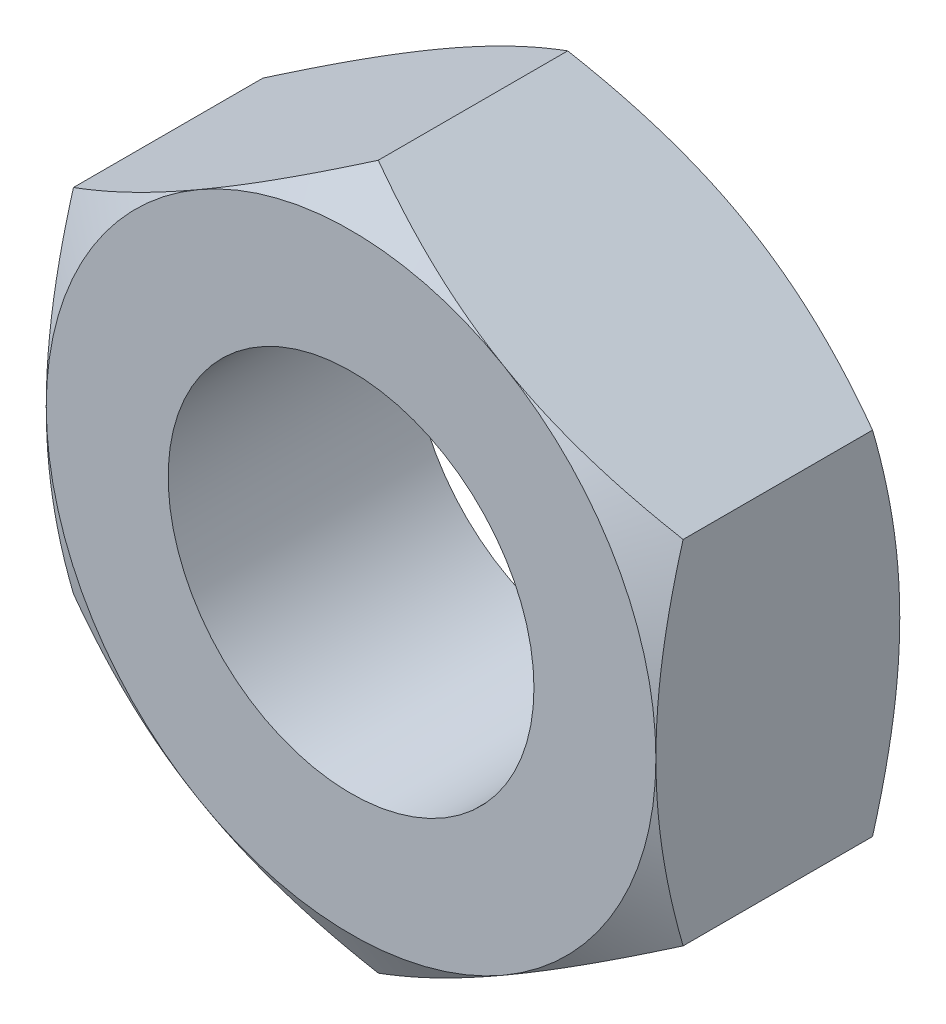
ISO-10303-21;
HEADER;
FILE_DESCRIPTION(('STEP AP214'),'2;1');
FILE_NAME('part.step','',(''),(''),'','','');
FILE_SCHEMA(('AUTOMOTIVE_DESIGN { 1 0 10303 214 1 1 1 1 }'));
ENDSEC;
DATA;
#1=APPLICATION_CONTEXT('core data for automotive mechanical design processes');
#2=APPLICATION_PROTOCOL_DEFINITION('international standard','automotive_design',2000,#1);
#3=PRODUCT_CONTEXT('',#1,'mechanical');
#4=PRODUCT('Part','Part','',(#3));
#5=PRODUCT_RELATED_PRODUCT_CATEGORY('part','',(#4));
#6=PRODUCT_DEFINITION_FORMATION('','',#4);
#7=PRODUCT_DEFINITION_CONTEXT('part definition',#1,'design');
#8=PRODUCT_DEFINITION('design','',#6,#7);
#9=PRODUCT_DEFINITION_SHAPE('','',#8);
#10=(LENGTH_UNIT() NAMED_UNIT(*) SI_UNIT(.MILLI.,.METRE.));
#11=(NAMED_UNIT(*) PLANE_ANGLE_UNIT() SI_UNIT($,.RADIAN.));
#12=(NAMED_UNIT(*) SI_UNIT($,.STERADIAN.) SOLID_ANGLE_UNIT());
#13=UNCERTAINTY_MEASURE_WITH_UNIT(LENGTH_MEASURE(1.E-05),#10,'distance_accuracy_value','');
#14=(GEOMETRIC_REPRESENTATION_CONTEXT(3) GLOBAL_UNCERTAINTY_ASSIGNED_CONTEXT((#13)) GLOBAL_UNIT_ASSIGNED_CONTEXT((#10,
#11,#12)) REPRESENTATION_CONTEXT('',''));
#15=CARTESIAN_POINT('',(0.,0.,0.));
#16=DIRECTION('',(0.,0.,1.));
#17=DIRECTION('',(1.,0.,0.));
#18=AXIS2_PLACEMENT_3D('',#15,#16,#17);
#19=CARTESIAN_POINT('',(5.,-2.88675134594813,4.));
#20=DIRECTION('',(-1.,0.,0.));
#21=DIRECTION('',(0.,-1.,0.));
#22=AXIS2_PLACEMENT_3D('',#19,#20,#21);
#23=PLANE('',#22);
#24=CARTESIAN_POINT('',(5.,-7.87365702374524,2.49824246177262));
#25=CARTESIAN_POINT('',(5.,-7.65424885502875,2.39133489704551));
#26=CARTESIAN_POINT('',(5.,-7.43434968409424,2.28541838123877));
#27=CARTESIAN_POINT('',(5.,-6.99330867925494,2.07612251772037));
#28=CARTESIAN_POINT('',(5.,-6.7721666663588,1.97274354759817));
#29=CARTESIAN_POINT('',(5.,-6.32729609313185,1.76858296880601));
#30=CARTESIAN_POINT('',(5.,-6.10356006992186,1.66781756778837));
#31=CARTESIAN_POINT('',(5.,-5.65434989118733,1.47025361278042));
#32=CARTESIAN_POINT('',(5.,-5.42887581495154,1.37345487909115));
#33=CARTESIAN_POINT('',(5.,-4.96809711127871,1.18164807742429));
#34=CARTESIAN_POINT('',(5.,-4.73271967970646,1.08681398352078));
#35=CARTESIAN_POINT('',(5.,-4.25925542191498,0.904038121223636));
#36=CARTESIAN_POINT('',(5.,-4.02116830152953,0.816097109482391));
#37=CARTESIAN_POINT('',(5.,-3.54231432801516,0.649328972077131));
#38=CARTESIAN_POINT('',(5.,-3.30155361802186,0.57048437876602));
#39=CARTESIAN_POINT('',(5.,-2.81658012058301,0.424359857630978));
#40=CARTESIAN_POINT('',(5.,-2.57236840808335,0.35707641098898));
#41=CARTESIAN_POINT('',(5.,-2.08174046598442,0.237589838052537));
#42=CARTESIAN_POINT('',(5.,-1.8353456687962,0.185300291534011));
#43=CARTESIAN_POINT('',(5.,-1.33936997354922,0.098666767783664));
#44=CARTESIAN_POINT('',(5.,-1.08978941335802,0.0643209034621322));
#45=CARTESIAN_POINT('',(5.,-0.591995989461854,0.0167583346671063));
#46=CARTESIAN_POINT('',(5.,-0.343810636996627,0.00326081447824516));
#47=CARTESIAN_POINT('',(5.,0.152821678078049,-0.00220791645847307));
#48=CARTESIAN_POINT('',(5.,0.40126864229908,0.00582100618568453));
#49=CARTESIAN_POINT('',(5.,0.819594152869288,0.0368840592829151));
#50=CARTESIAN_POINT('',(5.,0.989903770300655,0.054481943911245));
#51=CARTESIAN_POINT('',(5.,1.32934599526932,0.0987603808960871));
#52=CARTESIAN_POINT('',(5.,1.49847845273237,0.125442070446813));
#53=CARTESIAN_POINT('',(5.,2.0038465616241,0.217717814579668));
#54=CARTESIAN_POINT('',(5.,2.33788036042001,0.295527960528567));
#55=CARTESIAN_POINT('',(5.,2.83751063242943,0.431339617718643));
#56=CARTESIAN_POINT('',(5.,3.00567281408892,0.480447968040272));
#57=CARTESIAN_POINT('',(5.,3.34036616079545,0.583987885915508));
#58=CARTESIAN_POINT('',(5.,3.50689731426471,0.638419491225972));
#59=CARTESIAN_POINT('',(5.,3.83837707095122,0.751714131229274));
#60=CARTESIAN_POINT('',(5.,4.00332612085249,0.810575870973975));
#61=CARTESIAN_POINT('',(5.,4.3318428586292,0.932016210232612));
#62=CARTESIAN_POINT('',(5.,4.49541056884147,0.994594749512396));
#63=CARTESIAN_POINT('',(5.,4.90340400015803,1.15516084522963));
#64=CARTESIAN_POINT('',(5.,5.14705793432265,1.25510669402756));
#65=CARTESIAN_POINT('',(5.,5.63208626053286,1.46040213050535));
#66=CARTESIAN_POINT('',(5.,5.87346046322903,1.56575216245142));
#67=CARTESIAN_POINT('',(5.,6.35438607536506,1.7806908869771));
#68=CARTESIAN_POINT('',(5.,6.59393697905474,1.89028070774785));
#69=CARTESIAN_POINT('',(5.,7.07149214757666,2.11278643534646));
#70=CARTESIAN_POINT('',(5.,7.30949637176765,2.22570242914645));
#71=CARTESIAN_POINT('',(5.,7.78453533272983,2.454339621706));
#72=CARTESIAN_POINT('',(5.,8.02156839048279,2.57006430237626));
#73=CARTESIAN_POINT('',(5.,8.49456959449529,2.80367203518571));
#74=CARTESIAN_POINT('',(5.,8.7305377299469,2.92155510916938));
#75=CARTESIAN_POINT('',(5.,9.4370346318187,3.27778987447372));
#76=CARTESIAN_POINT('',(5.,9.90623898034697,3.51876746536817));
#77=CARTESIAN_POINT('',(5.,10.7985198872538,3.98285228032311));
#78=CARTESIAN_POINT('',(5.,11.2218199422359,4.20553183871158));
#79=CARTESIAN_POINT('',(5.,12.0668775666561,4.65384433467825));
#80=CARTESIAN_POINT('',(5.,12.488635062956,4.87947741002916));
#81=CARTESIAN_POINT('',(5.,13.3297110150964,5.33229431294477));
#82=CARTESIAN_POINT('',(5.,13.749032995792,5.55947160399438));
#83=CARTESIAN_POINT('',(5.,14.5867026359366,6.0155502688608));
#84=CARTESIAN_POINT('',(5.,15.0050503582046,6.24445152724897));
#85=CARTESIAN_POINT('',(5.,15.423046512472,6.47398871962846));
#86=B_SPLINE_CURVE_WITH_KNOTS('',3,(#24,#25,#26,#27,#28,#29,#30,#31,#32,#33,#34,#35,#36,#37,#38,
#39,#40,#41,#42,#43,#44,#45,#46,#47,#48,#49,#50,#51,#52,#53,#54,#55,#56,#57,#58,#59,#60,#61,#62,
#63,#64,#65,#66,#67,#68,#69,#70,#71,#72,#73,#74,#75,#76,#77,#78,#79,#80,#81,#82,#83,#84,#85),
.UNSPECIFIED.,.F.,.F.,(4,2,2,2,2,2,2,2,2,2,2,2,2,2,2,2,2,2,2,2,2,2,2,2,2,2,2,2,2,2,4),(0.,
0.732212282297523,1.46453286604466,2.20064276018113,2.93671926993475,3.69792700804941,
4.45921818712332,5.21902224743514,5.97859463812734,6.73369679743111,7.48871952863944,
8.23348098854562,8.97824706349488,9.49164934069588,10.0051159139624,11.0325662943055,
11.5580766629722,12.0835907592565,12.6089518375823,13.1343044042711,13.9242808129814,
14.7143222683444,15.5045754164238,16.2948492462655,17.0861586079798,17.8774759827379,
19.4598336576735,20.8947159090168,22.329665333546,23.7603825414794,25.1910047922547),.UNSPECIFIED.);
#87=CARTESIAN_POINT('',(5.,2.88675134594813,0.446581987385204));
#88=VERTEX_POINT('',#87);
#89=CARTESIAN_POINT('',(5.,0.,0.));
#90=VERTEX_POINT('',#89);
#91=EDGE_CURVE('E123',#88,#90,#86,.F.);
#92=ORIENTED_EDGE('',*,*,#91,.F.);
#93=DIRECTION('',(0.,0.,-1.));
#94=VECTOR('',#93,1.);
#95=CARTESIAN_POINT('',(5.,2.88675134594813,4.));
#96=LINE('',#95,#94);
#97=CARTESIAN_POINT('',(5.,2.88675134594813,3.5534180126148));
#98=VERTEX_POINT('',#97);
#99=EDGE_CURVE('E258',#98,#88,#96,.T.);
#100=ORIENTED_EDGE('',*,*,#99,.F.);
#101=CARTESIAN_POINT('',(5.,-7.87365702374524,1.50175753822738));
#102=CARTESIAN_POINT('',(5.,-7.65424885502875,1.60866510295449));
#103=CARTESIAN_POINT('',(5.,-7.43434968409424,1.71458161876123));
#104=CARTESIAN_POINT('',(5.,-6.99330867925494,1.92387748227963));
#105=CARTESIAN_POINT('',(5.,-6.7721666663588,2.02725645240183));
#106=CARTESIAN_POINT('',(5.,-6.32729609313185,2.23141703119399));
#107=CARTESIAN_POINT('',(5.,-6.10356006992186,2.33218243221163));
#108=CARTESIAN_POINT('',(5.,-5.65434989118734,2.52974638721958));
#109=CARTESIAN_POINT('',(5.,-5.42887581495154,2.62654512090885));
#110=CARTESIAN_POINT('',(5.,-4.96809711127871,2.81835192257571));
#111=CARTESIAN_POINT('',(5.,-4.73271967970646,2.91318601647922));
#112=CARTESIAN_POINT('',(5.,-4.25925542191498,3.09596187877636));
#113=CARTESIAN_POINT('',(5.,-4.02116830152953,3.18390289051761));
#114=CARTESIAN_POINT('',(5.,-3.54231432801516,3.35067102792287));
#115=CARTESIAN_POINT('',(5.,-3.30155361802186,3.42951562123398));
#116=CARTESIAN_POINT('',(5.,-2.81658012058301,3.57564014236902));
#117=CARTESIAN_POINT('',(5.,-2.57236840808335,3.64292358901102));
#118=CARTESIAN_POINT('',(5.,-2.08174046598442,3.76241016194746));
#119=CARTESIAN_POINT('',(5.,-1.83534566879621,3.81469970846599));
#120=CARTESIAN_POINT('',(5.,-1.33936997354922,3.90133323221634));
#121=CARTESIAN_POINT('',(5.,-1.08978941335803,3.93567909653787));
#122=CARTESIAN_POINT('',(5.,-0.591995989461855,3.98324166533289));
#123=CARTESIAN_POINT('',(5.,-0.343810636996628,3.99673918552175));
#124=CARTESIAN_POINT('',(5.,0.152821678078048,4.00220791645847));
#125=CARTESIAN_POINT('',(5.,0.401268642299079,3.99417899381431));
#126=CARTESIAN_POINT('',(5.,0.819594152869287,3.96311594071708));
#127=CARTESIAN_POINT('',(5.,0.989903770300654,3.94551805608875));
#128=CARTESIAN_POINT('',(5.,1.32934599526932,3.90123961910391));
#129=CARTESIAN_POINT('',(5.,1.49847845273237,3.87455792955319));
#130=CARTESIAN_POINT('',(5.,2.0038465616241,3.78228218542033));
#131=CARTESIAN_POINT('',(5.,2.33788036042001,3.70447203947143));
#132=CARTESIAN_POINT('',(5.,2.83751063242943,3.56866038228136));
#133=CARTESIAN_POINT('',(5.,3.00567281408892,3.51955203195973));
#134=CARTESIAN_POINT('',(5.,3.34036616079545,3.41601211408449));
#135=CARTESIAN_POINT('',(5.,3.50689731426471,3.36158050877403));
#136=CARTESIAN_POINT('',(5.,3.83837707095122,3.24828586877073));
#137=CARTESIAN_POINT('',(5.,4.00332612085249,3.18942412902602));
#138=CARTESIAN_POINT('',(5.,4.3318428586292,3.06798378976739));
#139=CARTESIAN_POINT('',(5.,4.49541056884148,3.0054052504876));
#140=CARTESIAN_POINT('',(5.,4.90340400015803,2.84483915477037));
#141=CARTESIAN_POINT('',(5.,5.14705793432266,2.74489330597244));
#142=CARTESIAN_POINT('',(5.,5.63208626053286,2.53959786949465));
#143=CARTESIAN_POINT('',(5.,5.87346046322903,2.43424783754858));
#144=CARTESIAN_POINT('',(5.,6.35438607536506,2.2193091130229));
#145=CARTESIAN_POINT('',(5.,6.59393697905474,2.10971929225215));
#146=CARTESIAN_POINT('',(5.,7.07149214757666,1.88721356465354));
#147=CARTESIAN_POINT('',(5.,7.30949637176766,1.77429757085355));
#148=CARTESIAN_POINT('',(5.,7.78453533272984,1.545660378294));
#149=CARTESIAN_POINT('',(5.,8.02156839048279,1.42993569762374));
#150=CARTESIAN_POINT('',(5.,8.49456959449529,1.19632796481429));
#151=CARTESIAN_POINT('',(5.,8.7305377299469,1.07844489083062));
#152=CARTESIAN_POINT('',(5.,9.4370346318187,0.72221012552628));
#153=CARTESIAN_POINT('',(5.,9.90623898034697,0.481232534631828));
#154=CARTESIAN_POINT('',(5.,10.7985198872538,0.0171477196768955));
#155=CARTESIAN_POINT('',(5.,11.2218199422359,-0.205531838711579));
#156=CARTESIAN_POINT('',(5.,12.0668775666561,-0.653844334678244));
#157=CARTESIAN_POINT('',(5.,12.488635062956,-0.879477410029158));
#158=CARTESIAN_POINT('',(5.,13.3297110150964,-1.33229431294477));
#159=CARTESIAN_POINT('',(5.,13.749032995792,-1.55947160399437));
#160=CARTESIAN_POINT('',(5.,14.5867026359366,-2.01555026886079));
#161=CARTESIAN_POINT('',(5.,15.0050503582046,-2.24445152724896));
#162=CARTESIAN_POINT('',(5.,15.423046512472,-2.47398871962846));
#163=B_SPLINE_CURVE_WITH_KNOTS('',3,(#101,#102,#103,#104,#105,#106,#107,#108,#109,#110,#111,
#112,#113,#114,#115,#116,#117,#118,#119,#120,#121,#122,#123,#124,#125,#126,#127,#128,#129,#130,
#131,#132,#133,#134,#135,#136,#137,#138,#139,#140,#141,#142,#143,#144,#145,#146,#147,#148,#149,
#150,#151,#152,#153,#154,#155,#156,#157,#158,#159,#160,#161,#162),.UNSPECIFIED.,.F.,.F.,(4,2,2,
2,2,2,2,2,2,2,2,2,2,2,2,2,2,2,2,2,2,2,2,2,2,2,2,2,2,2,4),(0.,0.732212282297521,1.46453286604466,
2.20064276018112,2.93671926993475,3.69792700804941,4.45921818712332,5.21902224743514,
5.97859463812734,6.73369679743111,7.48871952863944,8.23348098854562,8.97824706349488,
9.49164934069588,10.0051159139624,11.0325662943055,11.5580766629722,12.0835907592565,
12.6089518375823,13.1343044042711,13.9242808129814,14.7143222683444,15.5045754164238,
16.2948492462655,17.0861586079798,17.8774759827379,19.4598336576735,20.8947159090168,
22.329665333546,23.7603825414794,25.1910047922547),.UNSPECIFIED.);
#164=CARTESIAN_POINT('',(5.,0.,4.));
#165=VERTEX_POINT('',#164);
#166=EDGE_CURVE('E232',#165,#98,#163,.T.);
#167=ORIENTED_EDGE('',*,*,#166,.F.);
#168=CARTESIAN_POINT('',(5.,-2.88675134594813,3.55341801261479));
#169=VERTEX_POINT('',#168);
#170=EDGE_CURVE('E238',#169,#165,#163,.T.);
#171=ORIENTED_EDGE('',*,*,#170,.F.);
#172=DIRECTION('',(0.,0.,-1.));
#173=VECTOR('',#172,1.);
#174=CARTESIAN_POINT('',(5.,-2.88675134594813,4.));
#175=LINE('',#174,#173);
#176=CARTESIAN_POINT('',(5.,-2.88675134594813,0.446581987385205));
#177=VERTEX_POINT('',#176);
#178=EDGE_CURVE('E155',#169,#177,#175,.T.);
#179=ORIENTED_EDGE('',*,*,#178,.T.);
#180=EDGE_CURVE('E136',#90,#177,#86,.F.);
#181=ORIENTED_EDGE('',*,*,#180,.F.);
#182=EDGE_LOOP('',(#92,#100,#167,#171,#179,#181));
#183=FACE_BOUND('',#182,.T.);
#184=ADVANCED_FACE('F34',(#183),#23,.F.);
#185=CARTESIAN_POINT('',(5.,2.88675134594813,4.));
#186=DIRECTION('',(-0.5,-0.866025403784439,0.));
#187=DIRECTION('',(0.866025403784439,-0.5,0.));
#188=AXIS2_PLACEMENT_3D('',#185,#186,#187);
#189=PLANE('',#188);
#190=CARTESIAN_POINT('',(-0.000199999999997165,5.77361816195009,0.446648656051829));
#191=CARTESIAN_POINT('',(0.219534594525188,5.64675433465071,0.373386567637636));
#192=CARTESIAN_POINT('',(0.441148584459584,5.5188054379059,0.306751321918093));
#193=CARTESIAN_POINT('',(0.888213995453517,5.26069210252318,0.190438991010812));
#194=CARTESIAN_POINT('',(1.11367335959078,5.13052307794721,0.14080304991579));
#195=CARTESIAN_POINT('',(1.56183230522351,4.87177839004641,0.0635510254186995));
#196=CARTESIAN_POINT('',(1.7844620931042,4.74324302208387,0.0354203782834909));
#197=CARTESIAN_POINT('',(2.11918990184665,4.54998783160116,0.0101949219536862));
#198=CARTESIAN_POINT('',(2.23084219680506,4.48552534905128,0.00461345976948583));
#199=CARTESIAN_POINT('',(2.4542499706738,4.35654081066911,-0.000797783248527588));
#200=CARTESIAN_POINT('',(2.56600544629032,4.2920187567385,-0.000627741741794235));
#201=CARTESIAN_POINT('',(2.87218423085064,4.11524635305244,0.00775363179203907));
#202=CARTESIAN_POINT('',(3.06650608596722,4.00305457769146,0.0218297718972538));
#203=CARTESIAN_POINT('',(3.45386010199771,3.77941563226457,0.0664652571094331));
#204=CARTESIAN_POINT('',(3.64689090137157,3.66796924828418,0.0970398601475106));
#205=CARTESIAN_POINT('',(4.03502534247486,3.44387972423144,0.173468493621166));
#206=CARTESIAN_POINT('',(4.23007999864174,3.3312648659868,0.219646378878683));
#207=CARTESIAN_POINT('',(4.61728034535877,3.1077146415794,0.324451794491936));
#208=CARTESIAN_POINT('',(4.80943099540809,2.99677641204847,0.383054703437376));
#209=CARTESIAN_POINT('',(5.0002,2.88663587589429,0.446648656051831));
#210=B_SPLINE_CURVE_WITH_KNOTS('',3,(#190,#191,#192,#193,#194,#195,#196,#197,#198,#199,#200,
#201,#202,#203,#204,#205,#206,#207,#208,#209),.UNSPECIFIED.,.F.,.F.,(4,2,2,2,2,2,2,2,2,4),(0.,
0.792555841363091,1.58701660053333,2.36181537487281,2.74884076077325,3.13585419177295,
3.80962362599679,4.48401723901189,5.17336882348928,5.86136694793725),.UNSPECIFIED.);
#211=CARTESIAN_POINT('',(0.,5.77350269189626,0.446581987385204));
#212=VERTEX_POINT('',#211);
#213=CARTESIAN_POINT('',(2.5,4.33012701892219,0.));
#214=VERTEX_POINT('',#213);
#215=EDGE_CURVE('E49',#212,#214,#210,.T.);
#216=ORIENTED_EDGE('',*,*,#215,.F.);
#217=DIRECTION('',(0.,0.,-1.));
#218=VECTOR('',#217,1.);
#219=CARTESIAN_POINT('',(0.,5.77350269189626,4.));
#220=LINE('',#219,#218);
#221=CARTESIAN_POINT('',(0.,5.77350269189626,3.5534180126148));
#222=VERTEX_POINT('',#221);
#223=EDGE_CURVE('E255',#222,#212,#220,.T.);
#224=ORIENTED_EDGE('',*,*,#223,.F.);
#225=CARTESIAN_POINT('',(5.0002,2.88663587589429,3.55335134394817));
#226=CARTESIAN_POINT('',(4.78046540547482,3.01349970319368,3.62661343236236));
#227=CARTESIAN_POINT('',(4.55885141554042,3.14144859993849,3.69324867808191));
#228=CARTESIAN_POINT('',(4.11178600454649,3.39956193532121,3.80956100898919));
#229=CARTESIAN_POINT('',(3.88632664040923,3.52973095989718,3.85919695008421));
#230=CARTESIAN_POINT('',(3.43816769477649,3.78847564779798,3.9364489745813));
#231=CARTESIAN_POINT('',(3.21553790689581,3.91701101576052,3.96457962171651));
#232=CARTESIAN_POINT('',(2.88081009815336,4.11026620624323,3.98980507804631));
#233=CARTESIAN_POINT('',(2.76915780319494,4.17472868879311,3.99538654023051));
#234=CARTESIAN_POINT('',(2.5457500293262,4.30371322717528,4.00079778324853));
#235=CARTESIAN_POINT('',(2.43399455370969,4.36823528110589,4.00062774174179));
#236=CARTESIAN_POINT('',(2.12781576914936,4.54500768479194,3.99224636820796));
#237=CARTESIAN_POINT('',(1.93349391403279,4.65719946015293,3.97817022810275));
#238=CARTESIAN_POINT('',(1.54613989800229,4.88083840557981,3.93353474289057));
#239=CARTESIAN_POINT('',(1.35310909862843,4.9922847895602,3.90296013985249));
#240=CARTESIAN_POINT('',(0.964974657525146,5.21637431361295,3.82653150637883));
#241=CARTESIAN_POINT('',(0.769920001358266,5.32898917185759,3.78035362112132));
#242=CARTESIAN_POINT('',(0.382719654641234,5.55253939626498,3.67554820550806));
#243=CARTESIAN_POINT('',(0.190569004591916,5.66347762579592,3.61694529656262));
#244=CARTESIAN_POINT('',(-0.000199999999997548,5.7736181619501,3.55335134394817));
#245=B_SPLINE_CURVE_WITH_KNOTS('',3,(#225,#226,#227,#228,#229,#230,#231,#232,#233,#234,#235,
#236,#237,#238,#239,#240,#241,#242,#243,#244),.UNSPECIFIED.,.F.,.F.,(4,2,2,2,2,2,2,2,2,4),(0.,
0.792555841363091,1.58701660053333,2.36181537487281,2.74884076077326,3.13585419177295,
3.80962362599679,4.48401723901189,5.17336882348928,5.86136694793725),.UNSPECIFIED.);
#246=CARTESIAN_POINT('',(2.5,4.33012701892219,4.));
#247=VERTEX_POINT('',#246);
#248=EDGE_CURVE('E217',#247,#222,#245,.T.);
#249=ORIENTED_EDGE('',*,*,#248,.F.);
#250=EDGE_CURVE('E224',#98,#247,#245,.T.);
#251=ORIENTED_EDGE('',*,*,#250,.F.);
#252=ORIENTED_EDGE('',*,*,#99,.T.);
#253=EDGE_CURVE('E130',#214,#88,#210,.T.);
#254=ORIENTED_EDGE('',*,*,#253,.F.);
#255=EDGE_LOOP('',(#216,#224,#249,#251,#252,#254));
#256=FACE_BOUND('',#255,.T.);
#257=ADVANCED_FACE('F209',(#256),#189,.F.);
#258=CARTESIAN_POINT('',(0.,5.77350269189626,4.));
#259=DIRECTION('',(0.5,-0.866025403784439,0.));
#260=DIRECTION('',(0.866025403784439,0.5,0.));
#261=AXIS2_PLACEMENT_3D('',#258,#259,#260);
#262=PLANE('',#261);
#263=CARTESIAN_POINT('',(-5.0002,2.88663587589429,0.446648656051829));
#264=CARTESIAN_POINT('',(-4.78046540547481,3.01349970319368,0.373386567637636));
#265=CARTESIAN_POINT('',(-4.55885141554042,3.14144859993849,0.306751321918093));
#266=CARTESIAN_POINT('',(-4.11178600454648,3.39956193532121,0.190438991010812));
#267=CARTESIAN_POINT('',(-3.88632664040922,3.52973095989718,0.14080304991579));
#268=CARTESIAN_POINT('',(-3.43816769477649,3.78847564779798,0.0635510254186989));
#269=CARTESIAN_POINT('',(-3.2155379068958,3.91701101576052,0.0354203782834906));
#270=CARTESIAN_POINT('',(-2.88081009815335,4.11026620624323,0.0101949219536856));
#271=CARTESIAN_POINT('',(-2.76915780319493,4.17472868879311,0.00461345976948498));
#272=CARTESIAN_POINT('',(-2.5457500293262,4.30371322717528,-0.000797783248528538));
#273=CARTESIAN_POINT('',(-2.43399455370968,4.36823528110589,-0.000627741741795037));
#274=CARTESIAN_POINT('',(-2.12781576914936,4.54500768479194,0.00775363179203862));
#275=CARTESIAN_POINT('',(-1.93349391403278,4.65719946015293,0.0218297718972534));
#276=CARTESIAN_POINT('',(-1.54613989800229,4.88083840557981,0.0664652571094324));
#277=CARTESIAN_POINT('',(-1.35310909862843,4.9922847895602,0.0970398601475096));
#278=CARTESIAN_POINT('',(-0.964974657525143,5.21637431361295,0.173468493621165));
#279=CARTESIAN_POINT('',(-0.769920001358261,5.32898917185759,0.219646378878682));
#280=CARTESIAN_POINT('',(-0.382719654641229,5.55253939626498,0.324451794491936));
#281=CARTESIAN_POINT('',(-0.190569004591911,5.66347762579592,0.383054703437376));
#282=CARTESIAN_POINT('',(0.000200000000002037,5.77361816195009,0.44664865605183));
#283=B_SPLINE_CURVE_WITH_KNOTS('',3,(#263,#264,#265,#266,#267,#268,#269,#270,#271,#272,#273,
#274,#275,#276,#277,#278,#279,#280,#281,#282),.UNSPECIFIED.,.F.,.F.,(4,2,2,2,2,2,2,2,2,4),(0.,
0.792555841363091,1.58701660053333,2.3618153748728,2.74884076077325,3.13585419177295,
3.80962362599679,4.48401723901189,5.17336882348928,5.86136694793725),.UNSPECIFIED.);
#284=CARTESIAN_POINT('',(-5.,2.88675134594813,0.446581987385203));
#285=VERTEX_POINT('',#284);
#286=CARTESIAN_POINT('',(-2.5,4.33012701892219,0.));
#287=VERTEX_POINT('',#286);
#288=EDGE_CURVE('E57',#285,#287,#283,.T.);
#289=ORIENTED_EDGE('',*,*,#288,.F.);
#290=DIRECTION('',(0.,0.,-1.));
#291=VECTOR('',#290,1.);
#292=CARTESIAN_POINT('',(-5.,2.88675134594813,4.));
#293=LINE('',#292,#291);
#294=CARTESIAN_POINT('',(-5.,2.88675134594813,3.5534180126148));
#295=VERTEX_POINT('',#294);
#296=EDGE_CURVE('E252',#295,#285,#293,.T.);
#297=ORIENTED_EDGE('',*,*,#296,.F.);
#298=CARTESIAN_POINT('',(0.000200000000002722,5.7736181619501,3.55335134394817));
#299=CARTESIAN_POINT('',(-0.219534594525183,5.64675433465071,3.62661343236236));
#300=CARTESIAN_POINT('',(-0.441148584459578,5.5188054379059,3.69324867808191));
#301=CARTESIAN_POINT('',(-0.888213995453511,5.26069210252318,3.80956100898919));
#302=CARTESIAN_POINT('',(-1.11367335959077,5.13052307794721,3.85919695008421));
#303=CARTESIAN_POINT('',(-1.56183230522351,4.87177839004641,3.9364489745813));
#304=CARTESIAN_POINT('',(-1.78446209310419,4.74324302208387,3.96457962171651));
#305=CARTESIAN_POINT('',(-2.11918990184664,4.54998783160116,3.98980507804631));
#306=CARTESIAN_POINT('',(-2.23084219680506,4.48552534905128,3.99538654023051));
#307=CARTESIAN_POINT('',(-2.4542499706738,4.35654081066911,4.00079778324853));
#308=CARTESIAN_POINT('',(-2.56600544629031,4.2920187567385,4.00062774174179));
#309=CARTESIAN_POINT('',(-2.87218423085064,4.11524635305244,3.99224636820796));
#310=CARTESIAN_POINT('',(-3.06650608596721,4.00305457769146,3.97817022810275));
#311=CARTESIAN_POINT('',(-3.4538601019977,3.77941563226458,3.93353474289057));
#312=CARTESIAN_POINT('',(-3.64689090137157,3.66796924828419,3.90296013985249));
#313=CARTESIAN_POINT('',(-4.03502534247485,3.44387972423144,3.82653150637883));
#314=CARTESIAN_POINT('',(-4.23007999864173,3.3312648659868,3.78035362112132));
#315=CARTESIAN_POINT('',(-4.61728034535877,3.10771464157941,3.67554820550806));
#316=CARTESIAN_POINT('',(-4.80943099540808,2.99677641204847,3.61694529656262));
#317=CARTESIAN_POINT('',(-5.0002,2.88663587589429,3.55335134394817));
#318=B_SPLINE_CURVE_WITH_KNOTS('',3,(#298,#299,#300,#301,#302,#303,#304,#305,#306,#307,#308,
#309,#310,#311,#312,#313,#314,#315,#316,#317),.UNSPECIFIED.,.F.,.F.,(4,2,2,2,2,2,2,2,2,4),(0.,
0.792555841363091,1.58701660053333,2.36181537487281,2.74884076077326,3.13585419177295,
3.80962362599679,4.48401723901189,5.17336882348929,5.86136694793725),.UNSPECIFIED.);
#319=CARTESIAN_POINT('',(-2.5,4.33012701892219,4.));
#320=VERTEX_POINT('',#319);
#321=EDGE_CURVE('E226',#320,#295,#318,.T.);
#322=ORIENTED_EDGE('',*,*,#321,.F.);
#323=EDGE_CURVE('E225',#222,#320,#318,.T.);
#324=ORIENTED_EDGE('',*,*,#323,.F.);
#325=ORIENTED_EDGE('',*,*,#223,.T.);
#326=EDGE_CURVE('E202',#287,#212,#283,.T.);
#327=ORIENTED_EDGE('',*,*,#326,.F.);
#328=EDGE_LOOP('',(#289,#297,#322,#324,#325,#327));
#329=FACE_BOUND('',#328,.T.);
#330=ADVANCED_FACE('F212',(#329),#262,.F.);
#331=CARTESIAN_POINT('',(-5.,2.88675134594813,4.));
#332=DIRECTION('',(1.,0.,0.));
#333=DIRECTION('',(0.,0.,-1.));
#334=AXIS2_PLACEMENT_3D('',#331,#332,#333);
#335=PLANE('',#334);
#336=CARTESIAN_POINT('',(-5.,-7.87365701887669,2.49824245939977));
#337=CARTESIAN_POINT('',(-5.,-7.65424885032401,2.39133489477146));
#338=CARTESIAN_POINT('',(-5.,-7.43434967955343,2.28541837906348));
#339=CARTESIAN_POINT('',(-5.,-6.99330867504247,2.0761225157421));
#340=CARTESIAN_POINT('',(-5.,-6.77216666231075,1.97274354571818));
#341=CARTESIAN_POINT('',(-5.,-6.3272960894151,1.76858296712263));
#342=CARTESIAN_POINT('',(-5.,-6.10356006637201,1.66781756620329));
#343=CARTESIAN_POINT('',(-5.,-5.6543498879724,1.47025361139034));
#344=CARTESIAN_POINT('',(-5.,-5.42887581190462,1.37345487779777));
#345=CARTESIAN_POINT('',(-5.,-4.9680971085814,1.1816480763274));
#346=CARTESIAN_POINT('',(-5.,-4.73271967719086,1.08681398252345));
#347=CARTESIAN_POINT('',(-5.,-4.25925541976572,0.904038120420157));
#348=CARTESIAN_POINT('',(-5.,-4.02116829956489,0.816097108773204));
#349=CARTESIAN_POINT('',(-5.,-3.54231432642315,0.649328971547606));
#350=CARTESIAN_POINT('',(-5.,-3.30155361661786,0.57048437832189));
#351=CARTESIAN_POINT('',(-5.,-2.81658011956012,0.424359857343855));
#352=CARTESIAN_POINT('',(-5.,-2.57236840725357,0.357076410773478));
#353=CARTESIAN_POINT('',(-5.,-2.08174046563879,0.23758983798168));
#354=CARTESIAN_POINT('',(-5.,-1.83534566874296,0.18530029153077));
#355=CARTESIAN_POINT('',(-5.,-1.33936997408792,0.098666767871708));
#356=CARTESIAN_POINT('',(-5.,-1.08978941419627,0.0643209035738788));
#357=CARTESIAN_POINT('',(-5.,-0.59199599089424,0.0167583347727771));
#358=CARTESIAN_POINT('',(-5.,-0.343810638723543,0.00326081455514294));
#359=CARTESIAN_POINT('',(-5.,0.152821675766435,-0.00220791649085196));
#360=CARTESIAN_POINT('',(-5.,0.4012686396973,0.00582100607278985));
#361=CARTESIAN_POINT('',(-5.,0.819594149904717,0.0368840590071786));
#362=CARTESIAN_POINT('',(-5.,0.989903767260167,0.0544819435710866));
#363=CARTESIAN_POINT('',(-5.,1.32934599208044,0.0987603804236836));
#364=CARTESIAN_POINT('',(-5.,1.49847844947102,0.125442069906586));
#365=CARTESIAN_POINT('',(-5.,2.00384655814937,0.217717813834578));
#366=CARTESIAN_POINT('',(-5.,2.33788035680874,0.295527959645137));
#367=CARTESIAN_POINT('',(-5.,2.83751062861404,0.431339616631237));
#368=CARTESIAN_POINT('',(-5.,3.00567281020404,0.480447966884446));
#369=CARTESIAN_POINT('',(-5.,3.34036615677241,0.583987884624979));
#370=CARTESIAN_POINT('',(-5.,3.50689731017297,0.638419489869161));
#371=CARTESIAN_POINT('',(-5.,3.83837706672264,0.751714129742321));
#372=CARTESIAN_POINT('',(-5.,4.00332611655575,0.810575869423167));
#373=CARTESIAN_POINT('',(-5.,4.33184285419612,0.932016208556361));
#374=CARTESIAN_POINT('',(-5.,4.49541056434023,0.994594747774557));
#375=CARTESIAN_POINT('',(-5.,4.90340399561369,1.1551608433905));
#376=CARTESIAN_POINT('',(-5.,5.14705792980183,1.2551066921537));
#377=CARTESIAN_POINT('',(-5.,5.63208625605622,1.46040212857094));
#378=CARTESIAN_POINT('',(-5.,5.87346045877304,1.56575216049117));
#379=CARTESIAN_POINT('',(-5.,6.35438607094821,1.78069088497184));
#380=CARTESIAN_POINT('',(-5.,6.59393697465637,1.89028070572342));
#381=CARTESIAN_POINT('',(-5.,7.07149214321332,2.11278643328859));
#382=CARTESIAN_POINT('',(-5.,7.30949636742086,2.22570242707433));
#383=CARTESIAN_POINT('',(-5.,7.78453532841544,2.45433961960945));
#384=CARTESIAN_POINT('',(-5.,8.02156838618425,2.57006430026955));
#385=CARTESIAN_POINT('',(-5.,8.49456959022721,2.80367203306155));
#386=CARTESIAN_POINT('',(-5.,8.73053772569342,2.92155510703791));
#387=CARTESIAN_POINT('',(-5.,9.43703462760724,3.27778987232347));
#388=CARTESIAN_POINT('',(-5.,9.90623897616145,3.51876746320969));
#389=CARTESIAN_POINT('',(-5.,10.7985198830968,3.9828522781444));
#390=CARTESIAN_POINT('',(-5.,11.2218199380818,4.20553183652025));
#391=CARTESIAN_POINT('',(-5.,12.0668775625066,4.65384433246444));
#392=CARTESIAN_POINT('',(-5.,12.4886350588081,4.87947740780551));
#393=CARTESIAN_POINT('',(-5.,13.3297110109473,5.33229431070149));
#394=CARTESIAN_POINT('',(-5.,13.74903299164,5.55947160174128));
#395=CARTESIAN_POINT('',(-5.,14.5867026317782,6.01555026658939));
#396=CARTESIAN_POINT('',(-5.,15.0050503540426,6.24445152496906));
#397=CARTESIAN_POINT('',(-5.,15.4230465083061,6.47398871734051));
#398=B_SPLINE_CURVE_WITH_KNOTS('',3,(#336,#337,#338,#339,#340,#341,#342,#343,#344,#345,#346,
#347,#348,#349,#350,#351,#352,#353,#354,#355,#356,#357,#358,#359,#360,#361,#362,#363,#364,#365,
#366,#367,#368,#369,#370,#371,#372,#373,#374,#375,#376,#377,#378,#379,#380,#381,#382,#383,#384,
#385,#386,#387,#388,#389,#390,#391,#392,#393,#394,#395,#396,#397),.UNSPECIFIED.,.F.,.F.,(4,2,2,
2,2,2,2,2,2,2,2,2,2,2,2,2,2,2,2,2,2,2,2,2,2,2,2,2,2,2,4),(0.,0.732212281725905,1.46453286490135,
2.20064275846017,2.9367192676362,3.69792700513364,4.45921818359013,5.21902224328652,
5.97859463336376,6.73369679176926,7.48871952208064,8.23348098111262,8.97824705518729,
9.49164933214193,10.0051159051621,11.0325662850113,11.5580766534203,12.0835907494469,
12.6089518275156,13.1343043939473,13.9242808026831,14.7143222580717,15.5045754061775,
16.2948492360457,17.0861585977894,17.8774759725768,19.4598336475702,20.8947158989035,
22.3296653234232,23.760382531335,25.1910047820885),.UNSPECIFIED.);
#399=CARTESIAN_POINT('',(-5.,-2.88675134594813,0.446581987385202));
#400=VERTEX_POINT('',#399);
#401=CARTESIAN_POINT('',(-5.,0.,0.));
#402=VERTEX_POINT('',#401);
#403=EDGE_CURVE('E170',#400,#402,#398,.T.);
#404=ORIENTED_EDGE('',*,*,#403,.F.);
#405=DIRECTION('',(0.,0.,-1.));
#406=VECTOR('',#405,1.);
#407=CARTESIAN_POINT('',(-5.,-2.88675134594813,4.));
#408=LINE('',#407,#406);
#409=CARTESIAN_POINT('',(-5.,-2.88675134594813,3.5534180126148));
#410=VERTEX_POINT('',#409);
#411=EDGE_CURVE('E249',#410,#400,#408,.T.);
#412=ORIENTED_EDGE('',*,*,#411,.F.);
#413=CARTESIAN_POINT('',(-5.,-7.87365701887669,1.50175754060023));
#414=CARTESIAN_POINT('',(-5.,-7.65424885032401,1.60866510522854));
#415=CARTESIAN_POINT('',(-5.,-7.43434967955343,1.71458162093652));
#416=CARTESIAN_POINT('',(-5.,-6.99330867504247,1.9238774842579));
#417=CARTESIAN_POINT('',(-5.,-6.77216666231075,2.02725645428182));
#418=CARTESIAN_POINT('',(-5.,-6.3272960894151,2.23141703287737));
#419=CARTESIAN_POINT('',(-5.,-6.10356006637201,2.33218243379671));
#420=CARTESIAN_POINT('',(-5.,-5.65434988797239,2.52974638860966));
#421=CARTESIAN_POINT('',(-5.,-5.42887581190461,2.62654512220223));
#422=CARTESIAN_POINT('',(-5.,-4.9680971085814,2.8183519236726));
#423=CARTESIAN_POINT('',(-5.,-4.73271967719086,2.91318601747655));
#424=CARTESIAN_POINT('',(-5.,-4.25925541976572,3.09596187957984));
#425=CARTESIAN_POINT('',(-5.,-4.02116829956488,3.1839028912268));
#426=CARTESIAN_POINT('',(-5.,-3.54231432642315,3.35067102845239));
#427=CARTESIAN_POINT('',(-5.,-3.30155361661786,3.42951562167811));
#428=CARTESIAN_POINT('',(-5.,-2.81658011956012,3.57564014265615));
#429=CARTESIAN_POINT('',(-5.,-2.57236840725357,3.64292358922652));
#430=CARTESIAN_POINT('',(-5.,-2.08174046563879,3.76241016201832));
#431=CARTESIAN_POINT('',(-5.,-1.83534566874296,3.81469970846923));
#432=CARTESIAN_POINT('',(-5.,-1.33936997408791,3.90133323212829));
#433=CARTESIAN_POINT('',(-5.,-1.08978941419627,3.93567909642612));
#434=CARTESIAN_POINT('',(-5.,-0.59199599089424,3.98324166522722));
#435=CARTESIAN_POINT('',(-5.,-0.343810638723543,3.99673918544486));
#436=CARTESIAN_POINT('',(-5.,0.152821675766435,4.00220791649085));
#437=CARTESIAN_POINT('',(-5.,0.4012686396973,3.99417899392721));
#438=CARTESIAN_POINT('',(-5.,0.819594149904717,3.96311594099282));
#439=CARTESIAN_POINT('',(-5.,0.989903767260168,3.94551805642891));
#440=CARTESIAN_POINT('',(-5.,1.32934599208044,3.90123961957632));
#441=CARTESIAN_POINT('',(-5.,1.49847844947102,3.87455793009341));
#442=CARTESIAN_POINT('',(-5.,2.00384655814937,3.78228218616542));
#443=CARTESIAN_POINT('',(-5.,2.33788035680875,3.70447204035486));
#444=CARTESIAN_POINT('',(-5.,2.83751062861404,3.56866038336876));
#445=CARTESIAN_POINT('',(-5.,3.00567281020404,3.51955203311555));
#446=CARTESIAN_POINT('',(-5.,3.34036615677241,3.41601211537502));
#447=CARTESIAN_POINT('',(-5.,3.50689731017297,3.36158051013084));
#448=CARTESIAN_POINT('',(-5.,3.83837706672264,3.24828587025768));
#449=CARTESIAN_POINT('',(-5.,4.00332611655575,3.18942413057683));
#450=CARTESIAN_POINT('',(-5.,4.33184285419612,3.06798379144364));
#451=CARTESIAN_POINT('',(-5.,4.49541056434023,3.00540525222544));
#452=CARTESIAN_POINT('',(-5.,4.90340399561369,2.84483915660949));
#453=CARTESIAN_POINT('',(-5.,5.14705792980183,2.74489330784629));
#454=CARTESIAN_POINT('',(-5.,5.63208625605622,2.53959787142906));
#455=CARTESIAN_POINT('',(-5.,5.87346045877304,2.43424783950883));
#456=CARTESIAN_POINT('',(-5.,6.35438607094821,2.21930911502816));
#457=CARTESIAN_POINT('',(-5.,6.59393697465637,2.10971929427658));
#458=CARTESIAN_POINT('',(-5.,7.07149214321332,1.88721356671141));
#459=CARTESIAN_POINT('',(-5.,7.30949636742086,1.77429757292568));
#460=CARTESIAN_POINT('',(-5.,7.78453532841544,1.54566038039055));
#461=CARTESIAN_POINT('',(-5.,8.02156838618425,1.42993569973045));
#462=CARTESIAN_POINT('',(-5.,8.49456959022721,1.19632796693845));
#463=CARTESIAN_POINT('',(-5.,8.73053772569342,1.07844489296209));
#464=CARTESIAN_POINT('',(-5.,9.43703462760723,0.722210127676534));
#465=CARTESIAN_POINT('',(-5.,9.90623897616144,0.481232536790315));
#466=CARTESIAN_POINT('',(-5.,10.7985198830968,0.0171477218556014));
#467=CARTESIAN_POINT('',(-5.,11.2218199380818,-0.205531836520242));
#468=CARTESIAN_POINT('',(-5.,12.0668775625066,-0.653844332464431));
#469=CARTESIAN_POINT('',(-5.,12.4886350588081,-0.879477407805501));
#470=CARTESIAN_POINT('',(-5.,13.3297110109473,-1.33229431070148));
#471=CARTESIAN_POINT('',(-5.,13.74903299164,-1.55947160174127));
#472=CARTESIAN_POINT('',(-5.,14.5867026317782,-2.01555026658938));
#473=CARTESIAN_POINT('',(-5.,15.0050503540426,-2.24445152496906));
#474=CARTESIAN_POINT('',(-5.,15.4230465083061,-2.47398871734051));
#475=B_SPLINE_CURVE_WITH_KNOTS('',3,(#413,#414,#415,#416,#417,#418,#419,#420,#421,#422,#423,
#424,#425,#426,#427,#428,#429,#430,#431,#432,#433,#434,#435,#436,#437,#438,#439,#440,#441,#442,
#443,#444,#445,#446,#447,#448,#449,#450,#451,#452,#453,#454,#455,#456,#457,#458,#459,#460,#461,
#462,#463,#464,#465,#466,#467,#468,#469,#470,#471,#472,#473,#474),.UNSPECIFIED.,.F.,.F.,(4,2,2,
2,2,2,2,2,2,2,2,2,2,2,2,2,2,2,2,2,2,2,2,2,2,2,2,2,2,2,4),(0.,0.732212281725903,1.46453286490134,
2.20064275846017,2.9367192676362,3.69792700513364,4.45921818359013,5.21902224328652,
5.97859463336376,6.73369679176926,7.48871952208063,8.23348098111262,8.97824705518729,
9.49164933214193,10.0051159051621,11.0325662850113,11.5580766534203,12.0835907494469,
12.6089518275156,13.1343043939473,13.9242808026831,14.7143222580717,15.5045754061775,
16.2948492360456,17.0861585977893,17.8774759725768,19.4598336475702,20.8947158989035,
22.3296653234231,23.760382531335,25.1910047820885),.UNSPECIFIED.);
#476=CARTESIAN_POINT('',(-5.,0.,4.));
#477=VERTEX_POINT('',#476);
#478=EDGE_CURVE('E286',#477,#410,#475,.F.);
#479=ORIENTED_EDGE('',*,*,#478,.F.);
#480=EDGE_CURVE('E291',#295,#477,#475,.F.);
#481=ORIENTED_EDGE('',*,*,#480,.F.);
#482=ORIENTED_EDGE('',*,*,#296,.T.);
#483=EDGE_CURVE('E342',#402,#285,#398,.T.);
#484=ORIENTED_EDGE('',*,*,#483,.F.);
#485=EDGE_LOOP('',(#404,#412,#479,#481,#482,#484));
#486=FACE_BOUND('',#485,.T.);
#487=ADVANCED_FACE('F274',(#486),#335,.F.);
#488=CARTESIAN_POINT('',(-5.,-2.88675134594813,4.));
#489=DIRECTION('',(0.5,0.866025403784438,0.));
#490=DIRECTION('',(-0.866025403784439,0.5,0.));
#491=AXIS2_PLACEMENT_3D('',#488,#489,#490);
#492=PLANE('',#491);
#493=CARTESIAN_POINT('',(0.000199999999999825,-5.7736181619501,0.446648656051831));
#494=CARTESIAN_POINT('',(-0.219534594525185,-5.64675433465071,0.373386567637637));
#495=CARTESIAN_POINT('',(-0.44114858445958,-5.5188054379059,0.306751321918094));
#496=CARTESIAN_POINT('',(-0.888213995453514,-5.26069210252318,0.190438991010812));
#497=CARTESIAN_POINT('',(-1.11367335959077,-5.13052307794721,0.140803049915791));
#498=CARTESIAN_POINT('',(-1.56183230522351,-4.87177839004641,0.0635510254187002));
#499=CARTESIAN_POINT('',(-1.78446209310419,-4.74324302208387,0.035420378283492));
#500=CARTESIAN_POINT('',(-2.11918990184664,-4.54998783160116,0.0101949219536865));
#501=CARTESIAN_POINT('',(-2.23084219680506,-4.48552534905128,0.0046134597694856));
#502=CARTESIAN_POINT('',(-2.4542499706738,-4.35654081066911,-0.000797783248528109));
#503=CARTESIAN_POINT('',(-2.56600544629032,-4.2920187567385,-0.000627741741794536));
#504=CARTESIAN_POINT('',(-2.87218423085064,-4.11524635305244,0.00775363179203929));
#505=CARTESIAN_POINT('',(-3.06650608596721,-4.00305457769146,0.0218297718972542));
#506=CARTESIAN_POINT('',(-3.45386010199771,-3.77941563226457,0.0664652571094329));
#507=CARTESIAN_POINT('',(-3.64689090137157,-3.66796924828418,0.0970398601475096));
#508=CARTESIAN_POINT('',(-4.03502534247485,-3.44387972423144,0.173468493621165));
#509=CARTESIAN_POINT('',(-4.23007999864173,-3.3312648659868,0.219646378878682));
#510=CARTESIAN_POINT('',(-4.61728034535877,-3.10771464157941,0.324451794491936));
#511=CARTESIAN_POINT('',(-4.80943099540808,-2.99677641204847,0.383054703437375));
#512=CARTESIAN_POINT('',(-5.0002,-2.88663587589429,0.446648656051829));
#513=B_SPLINE_CURVE_WITH_KNOTS('',3,(#493,#494,#495,#496,#497,#498,#499,#500,#501,#502,#503,
#504,#505,#506,#507,#508,#509,#510,#511,#512),.UNSPECIFIED.,.F.,.F.,(4,2,2,2,2,2,2,2,2,4),(0.,
0.792555841363091,1.58701660053334,2.36181537487281,2.74884076077326,3.13585419177295,
3.80962362599679,4.48401723901189,5.17336882348928,5.86136694793725),.UNSPECIFIED.);
#514=CARTESIAN_POINT('',(0.,-5.77350269189626,0.446581987385205));
#515=VERTEX_POINT('',#514);
#516=CARTESIAN_POINT('',(-2.5,-4.33012701892219,0.));
#517=VERTEX_POINT('',#516);
#518=EDGE_CURVE('E156',#515,#517,#513,.T.);
#519=ORIENTED_EDGE('',*,*,#518,.F.);
#520=DIRECTION('',(0.,0.,-1.));
#521=VECTOR('',#520,1.);
#522=CARTESIAN_POINT('',(0.,-5.77350269189626,4.));
#523=LINE('',#522,#521);
#524=CARTESIAN_POINT('',(0.,-5.77350269189626,3.5534180126148));
#525=VERTEX_POINT('',#524);
#526=EDGE_CURVE('E246',#525,#515,#523,.T.);
#527=ORIENTED_EDGE('',*,*,#526,.F.);
#528=CARTESIAN_POINT('',(-5.0002,-2.88663587589429,3.55335134394817));
#529=CARTESIAN_POINT('',(-4.78046540547481,-3.01349970319368,3.62661343236236));
#530=CARTESIAN_POINT('',(-4.55885141554042,-3.14144859993849,3.69324867808191));
#531=CARTESIAN_POINT('',(-4.11178600454648,-3.39956193532121,3.80956100898919));
#532=CARTESIAN_POINT('',(-3.88632664040922,-3.52973095989718,3.85919695008421));
#533=CARTESIAN_POINT('',(-3.43816769477649,-3.78847564779798,3.9364489745813));
#534=CARTESIAN_POINT('',(-3.2155379068958,-3.91701101576052,3.96457962171651));
#535=CARTESIAN_POINT('',(-2.88081009815335,-4.11026620624323,3.98980507804631));
#536=CARTESIAN_POINT('',(-2.76915780319493,-4.17472868879311,3.99538654023051));
#537=CARTESIAN_POINT('',(-2.5457500293262,-4.30371322717528,4.00079778324853));
#538=CARTESIAN_POINT('',(-2.43399455370968,-4.36823528110589,4.00062774174179));
#539=CARTESIAN_POINT('',(-2.12781576914936,-4.54500768479195,3.99224636820796));
#540=CARTESIAN_POINT('',(-1.93349391403278,-4.65719946015293,3.97817022810274));
#541=CARTESIAN_POINT('',(-1.54613989800229,-4.88083840557981,3.93353474289057));
#542=CARTESIAN_POINT('',(-1.35310909862843,-4.9922847895602,3.90296013985249));
#543=CARTESIAN_POINT('',(-0.964974657525144,-5.21637431361295,3.82653150637883));
#544=CARTESIAN_POINT('',(-0.769920001358263,-5.32898917185759,3.78035362112132));
#545=CARTESIAN_POINT('',(-0.382719654641231,-5.55253939626498,3.67554820550806));
#546=CARTESIAN_POINT('',(-0.190569004591913,-5.66347762579592,3.61694529656262));
#547=CARTESIAN_POINT('',(0.000199999999999552,-5.7736181619501,3.55335134394817));
#548=B_SPLINE_CURVE_WITH_KNOTS('',3,(#528,#529,#530,#531,#532,#533,#534,#535,#536,#537,#538,
#539,#540,#541,#542,#543,#544,#545,#546,#547),.UNSPECIFIED.,.F.,.F.,(4,2,2,2,2,2,2,2,2,4),(0.,
0.792555841363091,1.58701660053333,2.36181537487281,2.74884076077325,3.13585419177295,
3.80962362599679,4.48401723901189,5.17336882348928,5.86136694793725),.UNSPECIFIED.);
#549=CARTESIAN_POINT('',(-2.5,-4.3301270189222,4.));
#550=VERTEX_POINT('',#549);
#551=EDGE_CURVE('E279',#550,#525,#548,.T.);
#552=ORIENTED_EDGE('',*,*,#551,.F.);
#553=EDGE_CURVE('E284',#410,#550,#548,.T.);
#554=ORIENTED_EDGE('',*,*,#553,.F.);
#555=ORIENTED_EDGE('',*,*,#411,.T.);
#556=EDGE_CURVE('E135',#517,#400,#513,.T.);
#557=ORIENTED_EDGE('',*,*,#556,.F.);
#558=EDGE_LOOP('',(#519,#527,#552,#554,#555,#557));
#559=FACE_BOUND('',#558,.T.);
#560=ADVANCED_FACE('F268',(#559),#492,.F.);
#561=CARTESIAN_POINT('',(0.,-5.77350269189626,4.));
#562=DIRECTION('',(-0.5,0.866025403784439,0.));
#563=DIRECTION('',(-0.866025403784439,-0.5,0.));
#564=AXIS2_PLACEMENT_3D('',#561,#562,#563);
#565=PLANE('',#564);
#566=CARTESIAN_POINT('',(5.0002,-2.88663587589429,0.446648656051831));
#567=CARTESIAN_POINT('',(4.78046540547482,-3.01349970319368,0.373386567637638));
#568=CARTESIAN_POINT('',(4.55885141554042,-3.14144859993849,0.306751321918095));
#569=CARTESIAN_POINT('',(4.11178600454649,-3.39956193532121,0.190438991010813));
#570=CARTESIAN_POINT('',(3.88632664040923,-3.52973095989718,0.140803049915791));
#571=CARTESIAN_POINT('',(3.43816769477649,-3.78847564779798,0.0635510254187004));
#572=CARTESIAN_POINT('',(3.21553790689581,-3.91701101576052,0.0354203782834925));
#573=CARTESIAN_POINT('',(2.88081009815336,-4.11026620624323,0.0101949219536873));
#574=CARTESIAN_POINT('',(2.76915780319494,-4.17472868879311,0.00461345976948635));
#575=CARTESIAN_POINT('',(2.5457500293262,-4.30371322717528,-0.000797783248527555));
#576=CARTESIAN_POINT('',(2.43399455370969,-4.36823528110589,-0.000627741741794182));
#577=CARTESIAN_POINT('',(2.12781576914936,-4.54500768479195,0.00775363179203939));
#578=CARTESIAN_POINT('',(1.93349391403279,-4.65719946015293,0.0218297718972545));
#579=CARTESIAN_POINT('',(1.54613989800229,-4.88083840557981,0.0664652571094338));
#580=CARTESIAN_POINT('',(1.35310909862843,-4.9922847895602,0.097039860147511));
#581=CARTESIAN_POINT('',(0.964974657525145,-5.21637431361295,0.173468493621167));
#582=CARTESIAN_POINT('',(0.769920001358264,-5.32898917185759,0.219646378878683));
#583=CARTESIAN_POINT('',(0.382719654641232,-5.55253939626498,0.324451794491937));
#584=CARTESIAN_POINT('',(0.190569004591913,-5.66347762579592,0.383054703437377));
#585=CARTESIAN_POINT('',(-0.000200000000000034,-5.7736181619501,0.446648656051831));
#586=B_SPLINE_CURVE_WITH_KNOTS('',3,(#566,#567,#568,#569,#570,#571,#572,#573,#574,#575,#576,
#577,#578,#579,#580,#581,#582,#583,#584,#585),.UNSPECIFIED.,.F.,.F.,(4,2,2,2,2,2,2,2,2,4),(0.,
0.792555841363091,1.58701660053334,2.36181537487281,2.74884076077326,3.13585419177295,
3.80962362599679,4.48401723901189,5.17336882348929,5.86136694793725),.UNSPECIFIED.);
#587=CARTESIAN_POINT('',(2.5,-4.33012701892219,0.));
#588=VERTEX_POINT('',#587);
#589=EDGE_CURVE('E142',#177,#588,#586,.T.);
#590=ORIENTED_EDGE('',*,*,#589,.F.);
#591=ORIENTED_EDGE('',*,*,#178,.F.);
#592=CARTESIAN_POINT('',(-0.000200000000000228,-5.7736181619501,3.55335134394817));
#593=CARTESIAN_POINT('',(0.219534594525185,-5.64675433465071,3.62661343236236));
#594=CARTESIAN_POINT('',(0.44114858445958,-5.5188054379059,3.69324867808191));
#595=CARTESIAN_POINT('',(0.888213995453513,-5.26069210252318,3.80956100898919));
#596=CARTESIAN_POINT('',(1.11367335959077,-5.13052307794721,3.85919695008421));
#597=CARTESIAN_POINT('',(1.56183230522351,-4.87177839004641,3.9364489745813));
#598=CARTESIAN_POINT('',(1.78446209310419,-4.74324302208387,3.96457962171651));
#599=CARTESIAN_POINT('',(2.11918990184664,-4.54998783160116,3.98980507804631));
#600=CARTESIAN_POINT('',(2.23084219680506,-4.48552534905128,3.99538654023051));
#601=CARTESIAN_POINT('',(2.4542499706738,-4.35654081066911,4.00079778324853));
#602=CARTESIAN_POINT('',(2.56600544629032,-4.2920187567385,4.00062774174179));
#603=CARTESIAN_POINT('',(2.87218423085064,-4.11524635305244,3.99224636820796));
#604=CARTESIAN_POINT('',(3.06650608596722,-4.00305457769146,3.97817022810274));
#605=CARTESIAN_POINT('',(3.45386010199771,-3.77941563226457,3.93353474289057));
#606=CARTESIAN_POINT('',(3.64689090137157,-3.66796924828419,3.90296013985249));
#607=CARTESIAN_POINT('',(4.03502534247486,-3.44387972423144,3.82653150637883));
#608=CARTESIAN_POINT('',(4.23007999864174,-3.3312648659868,3.78035362112132));
#609=CARTESIAN_POINT('',(4.61728034535877,-3.10771464157941,3.67554820550806));
#610=CARTESIAN_POINT('',(4.80943099540809,-2.99677641204847,3.61694529656262));
#611=CARTESIAN_POINT('',(5.0002,-2.88663587589429,3.55335134394817));
#612=B_SPLINE_CURVE_WITH_KNOTS('',3,(#592,#593,#594,#595,#596,#597,#598,#599,#600,#601,#602,
#603,#604,#605,#606,#607,#608,#609,#610,#611),.UNSPECIFIED.,.F.,.F.,(4,2,2,2,2,2,2,2,2,4),(0.,
0.79255584136309,1.58701660053333,2.36181537487281,2.74884076077326,3.13585419177295,
3.80962362599679,4.48401723901189,5.17336882348929,5.86136694793725),.UNSPECIFIED.);
#613=CARTESIAN_POINT('',(2.5,-4.33012701892219,4.));
#614=VERTEX_POINT('',#613);
#615=EDGE_CURVE('E259',#614,#169,#612,.T.);
#616=ORIENTED_EDGE('',*,*,#615,.F.);
#617=EDGE_CURVE('E147',#525,#614,#612,.T.);
#618=ORIENTED_EDGE('',*,*,#617,.F.);
#619=ORIENTED_EDGE('',*,*,#526,.T.);
#620=EDGE_CURVE('E150',#588,#515,#586,.T.);
#621=ORIENTED_EDGE('',*,*,#620,.F.);
#622=EDGE_LOOP('',(#590,#591,#616,#618,#619,#621));
#623=FACE_BOUND('',#622,.T.);
#624=ADVANCED_FACE('F264',(#623),#565,.F.);
#625=CARTESIAN_POINT('',(0.,0.,0.));
#626=DIRECTION('',(0.,0.,1.));
#627=DIRECTION('',(1.,0.,0.));
#628=AXIS2_PLACEMENT_3D('',#625,#626,#627);
#629=PLANE('',#628);
#630=CARTESIAN_POINT('',(0.,0.,0.));
#631=DIRECTION('',(0.,0.,1.));
#632=DIRECTION('',(1.,0.,0.));
#633=AXIS2_PLACEMENT_3D('',#630,#631,#632);
#634=CIRCLE('',#633,3.);
#635=CARTESIAN_POINT('',(3.,0.,0.));
#636=VERTEX_POINT('',#635);
#637=EDGE_CURVE('E242',#636,#636,#634,.T.);
#638=ORIENTED_EDGE('',*,*,#637,.T.);
#639=EDGE_LOOP('',(#638));
#640=FACE_BOUND('',#639,.T.);
#641=CARTESIAN_POINT('',(0.,0.,0.));
#642=DIRECTION('',(0.,0.,1.));
#643=DIRECTION('',(1.,0.,0.));
#644=AXIS2_PLACEMENT_3D('',#641,#642,#643);
#645=CIRCLE('',#644,5.);
#646=EDGE_CURVE('E127',#90,#214,#645,.T.);
#647=ORIENTED_EDGE('',*,*,#646,.F.);
#648=CARTESIAN_POINT('',(0.,0.,0.));
#649=DIRECTION('',(0.,0.,1.));
#650=DIRECTION('',(1.,0.,0.));
#651=AXIS2_PLACEMENT_3D('',#648,#649,#650);
#652=CIRCLE('',#651,5.);
#653=EDGE_CURVE('E38',#588,#90,#652,.T.);
#654=ORIENTED_EDGE('',*,*,#653,.F.);
#655=EDGE_CURVE('E146',#517,#588,#652,.T.);
#656=ORIENTED_EDGE('',*,*,#655,.F.);
#657=EDGE_CURVE('E344',#402,#517,#652,.T.);
#658=ORIENTED_EDGE('',*,*,#657,.F.);
#659=EDGE_CURVE('E43',#287,#402,#652,.T.);
#660=ORIENTED_EDGE('',*,*,#659,.F.);
#661=EDGE_CURVE('E11',#214,#287,#652,.T.);
#662=ORIENTED_EDGE('',*,*,#661,.F.);
#663=EDGE_LOOP('',(#647,#654,#656,#658,#660,#662));
#664=FACE_BOUND('',#663,.T.);
#665=ADVANCED_FACE('F148',(#640,#664),#629,.F.);
#666=CARTESIAN_POINT('',(0.,0.,4.));
#667=DIRECTION('',(0.,0.,1.));
#668=DIRECTION('',(1.,0.,0.));
#669=AXIS2_PLACEMENT_3D('',#666,#667,#668);
#670=PLANE('',#669);
#671=CARTESIAN_POINT('',(0.,0.,4.));
#672=DIRECTION('',(0.,0.,1.));
#673=DIRECTION('',(1.,0.,0.));
#674=AXIS2_PLACEMENT_3D('',#671,#672,#673);
#675=CIRCLE('',#674,3.);
#676=CARTESIAN_POINT('',(3.,0.,4.));
#677=VERTEX_POINT('',#676);
#678=EDGE_CURVE('E239',#677,#677,#675,.T.);
#679=ORIENTED_EDGE('',*,*,#678,.F.);
#680=EDGE_LOOP('',(#679));
#681=FACE_BOUND('',#680,.T.);
#682=CARTESIAN_POINT('',(0.,0.,4.));
#683=DIRECTION('',(0.,0.,1.));
#684=DIRECTION('',(1.,0.,0.));
#685=AXIS2_PLACEMENT_3D('',#682,#683,#684);
#686=CIRCLE('',#685,5.);
#687=EDGE_CURVE('E315',#614,#165,#686,.T.);
#688=ORIENTED_EDGE('',*,*,#687,.T.);
#689=EDGE_CURVE('E285',#165,#247,#686,.T.);
#690=ORIENTED_EDGE('',*,*,#689,.T.);
#691=EDGE_CURVE('E314',#247,#320,#686,.T.);
#692=ORIENTED_EDGE('',*,*,#691,.T.);
#693=EDGE_CURVE('E313',#320,#477,#686,.T.);
#694=ORIENTED_EDGE('',*,*,#693,.T.);
#695=EDGE_CURVE('E300',#477,#550,#686,.T.);
#696=ORIENTED_EDGE('',*,*,#695,.T.);
#697=EDGE_CURVE('E311',#550,#614,#686,.T.);
#698=ORIENTED_EDGE('',*,*,#697,.T.);
#699=EDGE_LOOP('',(#688,#690,#692,#694,#696,#698));
#700=FACE_BOUND('',#699,.T.);
#701=ADVANCED_FACE('F310',(#681,#700),#670,.T.);
#702=CARTESIAN_POINT('',(0.,0.,4.));
#703=DIRECTION('',(0.,0.,-1.));
#704=DIRECTION('',(-1.,0.,0.));
#705=AXIS2_PLACEMENT_3D('',#702,#703,#704);
#706=CYLINDRICAL_SURFACE('',#705,3.);
#707=ORIENTED_EDGE('',*,*,#678,.T.);
#708=EDGE_LOOP('',(#707));
#709=FACE_BOUND('',#708,.T.);
#710=ORIENTED_EDGE('',*,*,#637,.F.);
#711=EDGE_LOOP('',(#710));
#712=FACE_BOUND('',#711,.T.);
#713=ADVANCED_FACE('F352',(#709,#712),#706,.F.);
#714=CARTESIAN_POINT('',(0.,0.,4.));
#715=DIRECTION('',(0.,0.,-1.));
#716=DIRECTION('',(-1.,0.,0.));
#717=AXIS2_PLACEMENT_3D('',#714,#715,#716);
#718=CONICAL_SURFACE('',#717,5.,1.0471975511966);
#719=ORIENTED_EDGE('',*,*,#170,.T.);
#720=ORIENTED_EDGE('',*,*,#687,.F.);
#721=ORIENTED_EDGE('',*,*,#615,.T.);
#722=EDGE_LOOP('',(#719,#720,#721));
#723=FACE_BOUND('',#722,.T.);
#724=ADVANCED_FACE('F184',(#723),#718,.T.);
#725=ORIENTED_EDGE('',*,*,#551,.T.);
#726=ORIENTED_EDGE('',*,*,#617,.T.);
#727=ORIENTED_EDGE('',*,*,#697,.F.);
#728=EDGE_LOOP('',(#725,#726,#727));
#729=FACE_BOUND('',#728,.T.);
#730=ADVANCED_FACE('F348',(#729),#718,.T.);
#731=ORIENTED_EDGE('',*,*,#478,.T.);
#732=ORIENTED_EDGE('',*,*,#553,.T.);
#733=ORIENTED_EDGE('',*,*,#695,.F.);
#734=EDGE_LOOP('',(#731,#732,#733));
#735=FACE_BOUND('',#734,.T.);
#736=ADVANCED_FACE('F298',(#735),#718,.T.);
#737=ORIENTED_EDGE('',*,*,#321,.T.);
#738=ORIENTED_EDGE('',*,*,#480,.T.);
#739=ORIENTED_EDGE('',*,*,#693,.F.);
#740=EDGE_LOOP('',(#737,#738,#739));
#741=FACE_BOUND('',#740,.T.);
#742=ADVANCED_FACE('F335',(#741),#718,.T.);
#743=ORIENTED_EDGE('',*,*,#248,.T.);
#744=ORIENTED_EDGE('',*,*,#323,.T.);
#745=ORIENTED_EDGE('',*,*,#691,.F.);
#746=EDGE_LOOP('',(#743,#744,#745));
#747=FACE_BOUND('',#746,.T.);
#748=ADVANCED_FACE('F322',(#747),#718,.T.);
#749=ORIENTED_EDGE('',*,*,#166,.T.);
#750=ORIENTED_EDGE('',*,*,#250,.T.);
#751=ORIENTED_EDGE('',*,*,#689,.F.);
#752=EDGE_LOOP('',(#749,#750,#751));
#753=FACE_BOUND('',#752,.T.);
#754=ADVANCED_FACE('F328',(#753),#718,.T.);
#755=CARTESIAN_POINT('',(0.,0.,2.));
#756=DIRECTION('',(0.,0.,1.));
#757=DIRECTION('',(1.,0.,0.));
#758=AXIS2_PLACEMENT_3D('',#755,#756,#757);
#759=CONICAL_SURFACE('',#758,8.46410161513777,1.0471975511966);
#760=ORIENTED_EDGE('',*,*,#180,.T.);
#761=ORIENTED_EDGE('',*,*,#589,.T.);
#762=ORIENTED_EDGE('',*,*,#653,.T.);
#763=EDGE_LOOP('',(#760,#761,#762));
#764=FACE_BOUND('',#763,.T.);
#765=ADVANCED_FACE('F140',(#764),#759,.T.);
#766=ORIENTED_EDGE('',*,*,#518,.T.);
#767=ORIENTED_EDGE('',*,*,#655,.T.);
#768=ORIENTED_EDGE('',*,*,#620,.T.);
#769=EDGE_LOOP('',(#766,#767,#768));
#770=FACE_BOUND('',#769,.T.);
#771=ADVANCED_FACE('F183',(#770),#759,.T.);
#772=ORIENTED_EDGE('',*,*,#403,.T.);
#773=ORIENTED_EDGE('',*,*,#657,.T.);
#774=ORIENTED_EDGE('',*,*,#556,.T.);
#775=EDGE_LOOP('',(#772,#773,#774));
#776=FACE_BOUND('',#775,.T.);
#777=ADVANCED_FACE('F182',(#776),#759,.T.);
#778=ORIENTED_EDGE('',*,*,#288,.T.);
#779=ORIENTED_EDGE('',*,*,#659,.T.);
#780=ORIENTED_EDGE('',*,*,#483,.T.);
#781=EDGE_LOOP('',(#778,#779,#780));
#782=FACE_BOUND('',#781,.T.);
#783=ADVANCED_FACE('F177',(#782),#759,.T.);
#784=ORIENTED_EDGE('',*,*,#326,.T.);
#785=ORIENTED_EDGE('',*,*,#215,.T.);
#786=ORIENTED_EDGE('',*,*,#661,.T.);
#787=EDGE_LOOP('',(#784,#785,#786));
#788=FACE_BOUND('',#787,.T.);
#789=ADVANCED_FACE('F181',(#788),#759,.T.);
#790=ORIENTED_EDGE('',*,*,#253,.T.);
#791=ORIENTED_EDGE('',*,*,#91,.T.);
#792=ORIENTED_EDGE('',*,*,#646,.T.);
#793=EDGE_LOOP('',(#790,#791,#792));
#794=FACE_BOUND('',#793,.T.);
#795=ADVANCED_FACE('F125',(#794),#759,.T.);
#796=CLOSED_SHELL('',(#184,#257,#330,#487,#560,#624,#665,#701,#713,#724,#730,#736,#742,#748,
#754,#765,#771,#777,#783,#789,#795));
#797=MANIFOLD_SOLID_BREP('B2',#796);
#798=ADVANCED_BREP_SHAPE_REPRESENTATION('',(#18,#797),#14);
#799=SHAPE_DEFINITION_REPRESENTATION(#9,#798);
ENDSEC;
END-ISO-10303-21;
